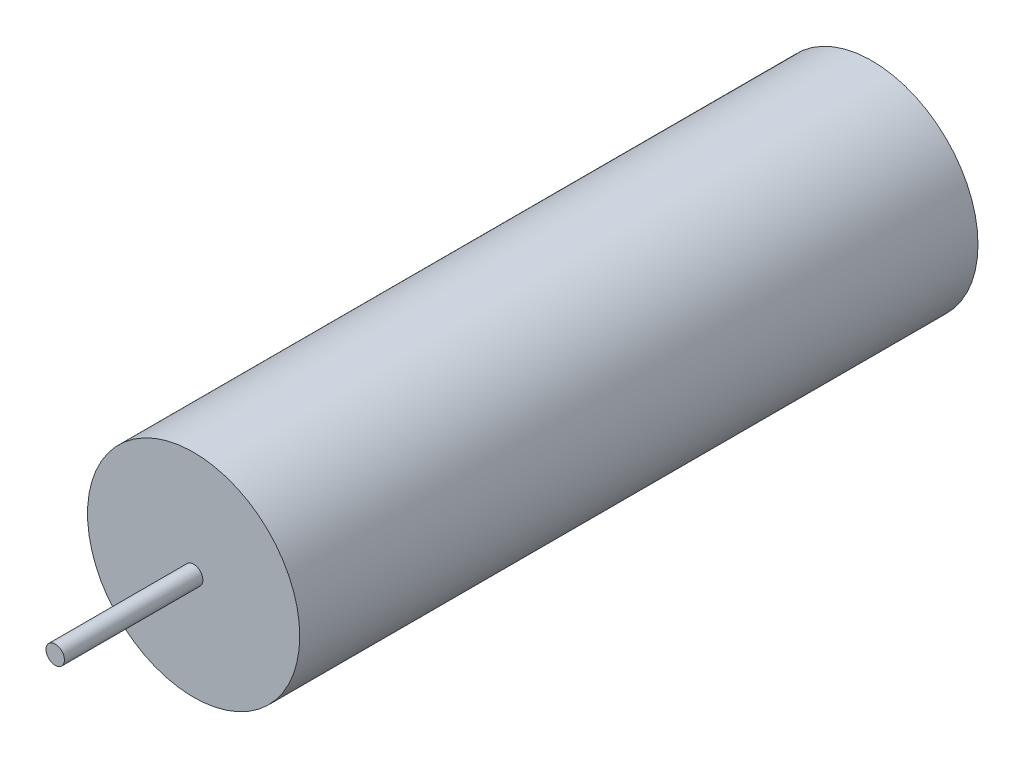
ISO-10303-21;
HEADER;
FILE_DESCRIPTION(('STEP AP214'),'2;1');
FILE_NAME('part.step','',(''),(''),'','','');
FILE_SCHEMA(('AUTOMOTIVE_DESIGN { 1 0 10303 214 1 1 1 1 }'));
ENDSEC;
DATA;
#1=APPLICATION_CONTEXT('core data for automotive mechanical design processes');
#2=APPLICATION_PROTOCOL_DEFINITION('international standard','automotive_design',2000,#1);
#3=PRODUCT_CONTEXT('',#1,'mechanical');
#4=PRODUCT('Part','Part','',(#3));
#5=PRODUCT_RELATED_PRODUCT_CATEGORY('part','',(#4));
#6=PRODUCT_DEFINITION_FORMATION('','',#4);
#7=PRODUCT_DEFINITION_CONTEXT('part definition',#1,'design');
#8=PRODUCT_DEFINITION('design','',#6,#7);
#9=PRODUCT_DEFINITION_SHAPE('','',#8);
#10=(LENGTH_UNIT() NAMED_UNIT(*) SI_UNIT(.MILLI.,.METRE.));
#11=(NAMED_UNIT(*) PLANE_ANGLE_UNIT() SI_UNIT($,.RADIAN.));
#12=(NAMED_UNIT(*) SI_UNIT($,.STERADIAN.) SOLID_ANGLE_UNIT());
#13=UNCERTAINTY_MEASURE_WITH_UNIT(LENGTH_MEASURE(1.E-05),#10,'distance_accuracy_value','');
#14=(GEOMETRIC_REPRESENTATION_CONTEXT(3) GLOBAL_UNCERTAINTY_ASSIGNED_CONTEXT((#13)) GLOBAL_UNIT_ASSIGNED_CONTEXT((#10,
#11,#12)) REPRESENTATION_CONTEXT('',''));
#15=CARTESIAN_POINT('',(0.,0.,0.));
#16=DIRECTION('',(0.,0.,1.));
#17=DIRECTION('',(1.,0.,0.));
#18=AXIS2_PLACEMENT_3D('',#15,#16,#17);
#19=CARTESIAN_POINT('',(0.,0.,18.669));
#20=DIRECTION('',(0.,0.,-1.));
#21=DIRECTION('',(-1.,0.,0.));
#22=AXIS2_PLACEMENT_3D('',#19,#20,#21);
#23=CYLINDRICAL_SURFACE('',#22,2.921);
#24=CARTESIAN_POINT('',(0.,0.,18.669));
#25=DIRECTION('',(0.,0.,1.));
#26=DIRECTION('',(1.,0.,0.));
#27=AXIS2_PLACEMENT_3D('',#24,#25,#26);
#28=CIRCLE('',#27,2.921);
#29=CARTESIAN_POINT('',(2.921,0.,18.669));
#30=VERTEX_POINT('',#29);
#31=EDGE_CURVE('E10',#30,#30,#28,.T.);
#32=ORIENTED_EDGE('',*,*,#31,.F.);
#33=EDGE_LOOP('',(#32));
#34=FACE_BOUND('',#33,.T.);
#35=CARTESIAN_POINT('',(0.,0.,0.));
#36=DIRECTION('',(0.,0.,1.));
#37=DIRECTION('',(1.,0.,0.));
#38=AXIS2_PLACEMENT_3D('',#35,#36,#37);
#39=CIRCLE('',#38,2.921);
#40=CARTESIAN_POINT('',(2.921,0.,0.));
#41=VERTEX_POINT('',#40);
#42=EDGE_CURVE('E34',#41,#41,#39,.T.);
#43=ORIENTED_EDGE('',*,*,#42,.T.);
#44=EDGE_LOOP('',(#43));
#45=FACE_BOUND('',#44,.T.);
#46=ADVANCED_FACE('F31',(#34,#45),#23,.T.);
#47=CARTESIAN_POINT('',(0.,0.,18.669));
#48=DIRECTION('',(0.,0.,1.));
#49=DIRECTION('',(1.,0.,0.));
#50=AXIS2_PLACEMENT_3D('',#47,#48,#49);
#51=PLANE('',#50);
#52=CARTESIAN_POINT('',(0.,0.,18.669));
#53=DIRECTION('',(0.,0.,1.));
#54=DIRECTION('',(1.,0.,0.));
#55=AXIS2_PLACEMENT_3D('',#52,#53,#54);
#56=CIRCLE('',#55,0.254);
#57=CARTESIAN_POINT('',(0.254,0.,18.669));
#58=VERTEX_POINT('',#57);
#59=EDGE_CURVE('E43',#58,#58,#56,.T.);
#60=ORIENTED_EDGE('',*,*,#59,.F.);
#61=EDGE_LOOP('',(#60));
#62=FACE_BOUND('',#61,.T.);
#63=ORIENTED_EDGE('',*,*,#31,.T.);
#64=EDGE_LOOP('',(#63));
#65=FACE_BOUND('',#64,.T.);
#66=ADVANCED_FACE('F58',(#62,#65),#51,.T.);
#67=CARTESIAN_POINT('',(0.,0.,0.));
#68=DIRECTION('',(0.,0.,1.));
#69=DIRECTION('',(1.,0.,0.));
#70=AXIS2_PLACEMENT_3D('',#67,#68,#69);
#71=PLANE('',#70);
#72=ORIENTED_EDGE('',*,*,#42,.F.);
#73=EDGE_LOOP('',(#72));
#74=FACE_BOUND('',#73,.T.);
#75=ADVANCED_FACE('F54',(#74),#71,.F.);
#76=CARTESIAN_POINT('',(0.,0.,22.479));
#77=DIRECTION('',(0.,0.,-1.));
#78=DIRECTION('',(-1.,0.,0.));
#79=AXIS2_PLACEMENT_3D('',#76,#77,#78);
#80=CYLINDRICAL_SURFACE('',#79,0.254);
#81=CARTESIAN_POINT('',(0.,0.,22.479));
#82=DIRECTION('',(0.,0.,1.));
#83=DIRECTION('',(1.,0.,0.));
#84=AXIS2_PLACEMENT_3D('',#81,#82,#83);
#85=CIRCLE('',#84,0.254);
#86=CARTESIAN_POINT('',(0.254,0.,22.479));
#87=VERTEX_POINT('',#86);
#88=EDGE_CURVE('E41',#87,#87,#85,.T.);
#89=ORIENTED_EDGE('',*,*,#88,.F.);
#90=EDGE_LOOP('',(#89));
#91=FACE_BOUND('',#90,.T.);
#92=ORIENTED_EDGE('',*,*,#59,.T.);
#93=EDGE_LOOP('',(#92));
#94=FACE_BOUND('',#93,.T.);
#95=ADVANCED_FACE('F51',(#91,#94),#80,.T.);
#96=CARTESIAN_POINT('',(0.,0.,22.479));
#97=DIRECTION('',(0.,0.,1.));
#98=DIRECTION('',(1.,0.,0.));
#99=AXIS2_PLACEMENT_3D('',#96,#97,#98);
#100=PLANE('',#99);
#101=ORIENTED_EDGE('',*,*,#88,.T.);
#102=EDGE_LOOP('',(#101));
#103=FACE_BOUND('',#102,.T.);
#104=ADVANCED_FACE('F49',(#103),#100,.T.);
#105=CLOSED_SHELL('',(#46,#66,#75,#95,#104));
#106=MANIFOLD_SOLID_BREP('B2',#105);
#107=ADVANCED_BREP_SHAPE_REPRESENTATION('',(#18,#106),#14);
#108=SHAPE_DEFINITION_REPRESENTATION(#9,#107);
ENDSEC;
END-ISO-10303-21;
